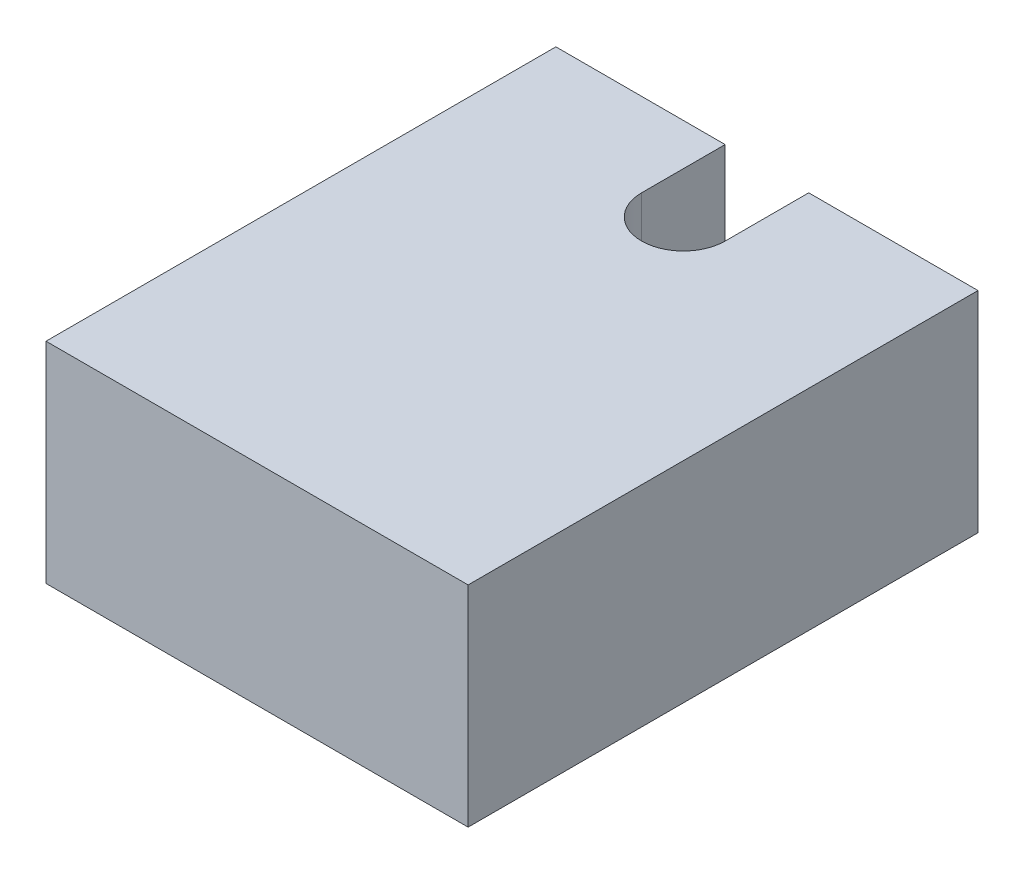
ISO-10303-21;
HEADER;
FILE_DESCRIPTION(('STEP AP214'),'2;1');
FILE_NAME('part.step','',(''),(''),'','','');
FILE_SCHEMA(('AUTOMOTIVE_DESIGN { 1 0 10303 214 1 1 1 1 }'));
ENDSEC;
DATA;
#1=APPLICATION_CONTEXT('core data for automotive mechanical design processes');
#2=APPLICATION_PROTOCOL_DEFINITION('international standard','automotive_design',2000,#1);
#3=PRODUCT_CONTEXT('',#1,'mechanical');
#4=PRODUCT('Part','Part','',(#3));
#5=PRODUCT_RELATED_PRODUCT_CATEGORY('part','',(#4));
#6=PRODUCT_DEFINITION_FORMATION('','',#4);
#7=PRODUCT_DEFINITION_CONTEXT('part definition',#1,'design');
#8=PRODUCT_DEFINITION('design','',#6,#7);
#9=PRODUCT_DEFINITION_SHAPE('','',#8);
#10=(LENGTH_UNIT() NAMED_UNIT(*) SI_UNIT(.MILLI.,.METRE.));
#11=(NAMED_UNIT(*) PLANE_ANGLE_UNIT() SI_UNIT($,.RADIAN.));
#12=(NAMED_UNIT(*) SI_UNIT($,.STERADIAN.) SOLID_ANGLE_UNIT());
#13=UNCERTAINTY_MEASURE_WITH_UNIT(LENGTH_MEASURE(1.E-05),#10,'distance_accuracy_value','');
#14=(GEOMETRIC_REPRESENTATION_CONTEXT(3) GLOBAL_UNCERTAINTY_ASSIGNED_CONTEXT((#13)) GLOBAL_UNIT_ASSIGNED_CONTEXT((#10,
#11,#12)) REPRESENTATION_CONTEXT('',''));
#15=CARTESIAN_POINT('',(0.,0.,0.));
#16=DIRECTION('',(0.,0.,1.));
#17=DIRECTION('',(1.,0.,0.));
#18=AXIS2_PLACEMENT_3D('',#15,#16,#17);
#19=CARTESIAN_POINT('',(2.025,2.51,-6.1));
#20=DIRECTION('',(-1.,0.,0.));
#21=DIRECTION('',(0.,0.,1.));
#22=AXIS2_PLACEMENT_3D('',#19,#20,#21);
#23=PLANE('',#22);
#24=DIRECTION('',(0.,0.,-1.));
#25=VECTOR('',#24,1.);
#26=CARTESIAN_POINT('',(2.025,0.,-6.1));
#27=LINE('',#26,#25);
#28=CARTESIAN_POINT('',(2.025,0.,-5.1));
#29=VERTEX_POINT('',#28);
#30=CARTESIAN_POINT('',(2.025,0.,-6.1));
#31=VERTEX_POINT('',#30);
#32=EDGE_CURVE('E91',#29,#31,#27,.T.);
#33=ORIENTED_EDGE('',*,*,#32,.T.);
#34=DIRECTION('',(0.,-1.,0.));
#35=VECTOR('',#34,1.);
#36=CARTESIAN_POINT('',(2.025,2.51,-6.1));
#37=LINE('',#36,#35);
#38=CARTESIAN_POINT('',(2.025,2.51,-6.1));
#39=VERTEX_POINT('',#38);
#40=EDGE_CURVE('E109',#39,#31,#37,.T.);
#41=ORIENTED_EDGE('',*,*,#40,.F.);
#42=DIRECTION('',(0.,0.,-1.));
#43=VECTOR('',#42,1.);
#44=CARTESIAN_POINT('',(2.025,2.51,-6.1));
#45=LINE('',#44,#43);
#46=CARTESIAN_POINT('',(2.025,2.51,-5.1));
#47=VERTEX_POINT('',#46);
#48=EDGE_CURVE('E106',#47,#39,#45,.T.);
#49=ORIENTED_EDGE('',*,*,#48,.F.);
#50=DIRECTION('',(0.,-1.,0.));
#51=VECTOR('',#50,1.);
#52=CARTESIAN_POINT('',(2.025,2.51,-5.1));
#53=LINE('',#52,#51);
#54=EDGE_CURVE('E104',#47,#29,#53,.T.);
#55=ORIENTED_EDGE('',*,*,#54,.T.);
#56=EDGE_LOOP('',(#33,#41,#49,#55));
#57=FACE_BOUND('',#56,.T.);
#58=CARTESIAN_POINT('',(2.025,1.255,-5.6));
#59=DIRECTION('',(-1.,0.,0.));
#60=DIRECTION('',(0.,0.,1.));
#61=AXIS2_PLACEMENT_3D('',#58,#59,#60);
#62=CIRCLE('',#61,0.25);
#63=CARTESIAN_POINT('',(2.025,1.255,-5.35));
#64=VERTEX_POINT('',#63);
#65=EDGE_CURVE('E11',#64,#64,#62,.F.);
#66=ORIENTED_EDGE('',*,*,#65,.F.);
#67=EDGE_LOOP('',(#66));
#68=FACE_BOUND('',#67,.T.);
#69=ADVANCED_FACE('F26',(#57,#68),#23,.F.);
#70=CARTESIAN_POINT('',(3.025,2.51,-5.1));
#71=DIRECTION('',(1.,0.,0.));
#72=DIRECTION('',(0.,0.,-1.));
#73=AXIS2_PLACEMENT_3D('',#70,#71,#72);
#74=PLANE('',#73);
#75=DIRECTION('',(0.,0.,1.));
#76=VECTOR('',#75,1.);
#77=CARTESIAN_POINT('',(3.025,0.,-5.1));
#78=LINE('',#77,#76);
#79=CARTESIAN_POINT('',(3.025,0.,-6.1));
#80=VERTEX_POINT('',#79);
#81=CARTESIAN_POINT('',(3.025,0.,-5.1));
#82=VERTEX_POINT('',#81);
#83=EDGE_CURVE('E124',#80,#82,#78,.T.);
#84=ORIENTED_EDGE('',*,*,#83,.T.);
#85=DIRECTION('',(0.,-1.,0.));
#86=VECTOR('',#85,1.);
#87=CARTESIAN_POINT('',(3.025,2.51,-5.1));
#88=LINE('',#87,#86);
#89=CARTESIAN_POINT('',(3.025,2.51,-5.1));
#90=VERTEX_POINT('',#89);
#91=EDGE_CURVE('E112',#90,#82,#88,.T.);
#92=ORIENTED_EDGE('',*,*,#91,.F.);
#93=DIRECTION('',(0.,0.,1.));
#94=VECTOR('',#93,1.);
#95=CARTESIAN_POINT('',(3.025,2.51,-5.1));
#96=LINE('',#95,#94);
#97=CARTESIAN_POINT('',(3.025,2.51,-6.1));
#98=VERTEX_POINT('',#97);
#99=EDGE_CURVE('E41',#98,#90,#96,.T.);
#100=ORIENTED_EDGE('',*,*,#99,.F.);
#101=DIRECTION('',(0.,-1.,0.));
#102=VECTOR('',#101,1.);
#103=CARTESIAN_POINT('',(3.025,2.51,-6.1));
#104=LINE('',#103,#102);
#105=EDGE_CURVE('E140',#98,#80,#104,.T.);
#106=ORIENTED_EDGE('',*,*,#105,.T.);
#107=EDGE_LOOP('',(#84,#92,#100,#106));
#108=FACE_BOUND('',#107,.T.);
#109=CARTESIAN_POINT('',(3.025,1.255,-5.6));
#110=DIRECTION('',(1.,0.,0.));
#111=DIRECTION('',(0.,0.,-1.));
#112=AXIS2_PLACEMENT_3D('',#109,#110,#111);
#113=CIRCLE('',#112,0.25);
#114=CARTESIAN_POINT('',(3.025,1.255,-5.85));
#115=VERTEX_POINT('',#114);
#116=EDGE_CURVE('E34',#115,#115,#113,.F.);
#117=ORIENTED_EDGE('',*,*,#116,.F.);
#118=EDGE_LOOP('',(#117));
#119=FACE_BOUND('',#118,.T.);
#120=ADVANCED_FACE('F161',(#108,#119),#74,.F.);
#121=CARTESIAN_POINT('',(2.525,2.51,-5.1));
#122=DIRECTION('',(0.,-1.,0.));
#123=DIRECTION('',(0.,0.,-1.));
#124=AXIS2_PLACEMENT_3D('',#121,#122,#123);
#125=CYLINDRICAL_SURFACE('',#124,0.5);
#126=CARTESIAN_POINT('',(2.525,0.,-5.1));
#127=DIRECTION('',(0.,-1.,0.));
#128=DIRECTION('',(0.,0.,1.));
#129=AXIS2_PLACEMENT_3D('',#126,#127,#128);
#130=CIRCLE('',#129,0.5);
#131=EDGE_CURVE('E96',#82,#29,#130,.T.);
#132=ORIENTED_EDGE('',*,*,#131,.T.);
#133=ORIENTED_EDGE('',*,*,#54,.F.);
#134=CARTESIAN_POINT('',(2.525,2.51,-5.1));
#135=DIRECTION('',(0.,-1.,0.));
#136=DIRECTION('',(0.,0.,1.));
#137=AXIS2_PLACEMENT_3D('',#134,#135,#136);
#138=CIRCLE('',#137,0.5);
#139=EDGE_CURVE('E126',#90,#47,#138,.T.);
#140=ORIENTED_EDGE('',*,*,#139,.F.);
#141=ORIENTED_EDGE('',*,*,#91,.T.);
#142=EDGE_LOOP('',(#132,#133,#140,#141));
#143=FACE_BOUND('',#142,.T.);
#144=ADVANCED_FACE('F28',(#143),#125,.F.);
#145=CARTESIAN_POINT('',(0.,2.51,-6.1));
#146=DIRECTION('',(0.,0.,1.));
#147=DIRECTION('',(1.,0.,0.));
#148=AXIS2_PLACEMENT_3D('',#145,#146,#147);
#149=PLANE('',#148);
#150=DIRECTION('',(-1.,0.,0.));
#151=VECTOR('',#150,1.);
#152=CARTESIAN_POINT('',(0.,0.,-6.1));
#153=LINE('',#152,#151);
#154=CARTESIAN_POINT('',(0.,0.,-6.1));
#155=VERTEX_POINT('',#154);
#156=EDGE_CURVE('E98',#31,#155,#153,.T.);
#157=ORIENTED_EDGE('',*,*,#156,.T.);
#158=DIRECTION('',(0.,-1.,0.));
#159=VECTOR('',#158,1.);
#160=CARTESIAN_POINT('',(0.,2.51,-6.1));
#161=LINE('',#160,#159);
#162=CARTESIAN_POINT('',(0.,2.51,-6.1));
#163=VERTEX_POINT('',#162);
#164=EDGE_CURVE('E152',#163,#155,#161,.T.);
#165=ORIENTED_EDGE('',*,*,#164,.F.);
#166=DIRECTION('',(-1.,0.,0.));
#167=VECTOR('',#166,1.);
#168=CARTESIAN_POINT('',(0.,2.51,-6.1));
#169=LINE('',#168,#167);
#170=EDGE_CURVE('E129',#39,#163,#169,.T.);
#171=ORIENTED_EDGE('',*,*,#170,.F.);
#172=ORIENTED_EDGE('',*,*,#40,.T.);
#173=EDGE_LOOP('',(#157,#165,#171,#172));
#174=FACE_BOUND('',#173,.T.);
#175=ADVANCED_FACE('F170',(#174),#149,.F.);
#176=CARTESIAN_POINT('',(0.,2.51,0.));
#177=DIRECTION('',(1.,0.,0.));
#178=DIRECTION('',(0.,0.,-1.));
#179=AXIS2_PLACEMENT_3D('',#176,#177,#178);
#180=PLANE('',#179);
#181=DIRECTION('',(0.,0.,1.));
#182=VECTOR('',#181,1.);
#183=CARTESIAN_POINT('',(0.,0.,0.));
#184=LINE('',#183,#182);
#185=CARTESIAN_POINT('',(0.,0.,0.));
#186=VERTEX_POINT('',#185);
#187=EDGE_CURVE('E116',#155,#186,#184,.T.);
#188=ORIENTED_EDGE('',*,*,#187,.T.);
#189=DIRECTION('',(0.,-1.,0.));
#190=VECTOR('',#189,1.);
#191=CARTESIAN_POINT('',(0.,2.51,0.));
#192=LINE('',#191,#190);
#193=CARTESIAN_POINT('',(0.,2.51,0.));
#194=VERTEX_POINT('',#193);
#195=EDGE_CURVE('E149',#194,#186,#192,.T.);
#196=ORIENTED_EDGE('',*,*,#195,.F.);
#197=DIRECTION('',(0.,0.,1.));
#198=VECTOR('',#197,1.);
#199=CARTESIAN_POINT('',(0.,2.51,0.));
#200=LINE('',#199,#198);
#201=EDGE_CURVE('E131',#163,#194,#200,.T.);
#202=ORIENTED_EDGE('',*,*,#201,.F.);
#203=ORIENTED_EDGE('',*,*,#164,.T.);
#204=EDGE_LOOP('',(#188,#196,#202,#203));
#205=FACE_BOUND('',#204,.T.);
#206=ADVANCED_FACE('F186',(#205),#180,.F.);
#207=CARTESIAN_POINT('',(5.05,2.51,0.));
#208=DIRECTION('',(0.,0.,-1.));
#209=DIRECTION('',(-1.,0.,0.));
#210=AXIS2_PLACEMENT_3D('',#207,#208,#209);
#211=PLANE('',#210);
#212=DIRECTION('',(1.,0.,0.));
#213=VECTOR('',#212,1.);
#214=CARTESIAN_POINT('',(5.05,0.,0.));
#215=LINE('',#214,#213);
#216=CARTESIAN_POINT('',(5.05,0.,0.));
#217=VERTEX_POINT('',#216);
#218=EDGE_CURVE('E118',#186,#217,#215,.T.);
#219=ORIENTED_EDGE('',*,*,#218,.T.);
#220=DIRECTION('',(0.,-1.,0.));
#221=VECTOR('',#220,1.);
#222=CARTESIAN_POINT('',(5.05,2.51,0.));
#223=LINE('',#222,#221);
#224=CARTESIAN_POINT('',(5.05,2.51,0.));
#225=VERTEX_POINT('',#224);
#226=EDGE_CURVE('E146',#225,#217,#223,.T.);
#227=ORIENTED_EDGE('',*,*,#226,.F.);
#228=DIRECTION('',(1.,0.,0.));
#229=VECTOR('',#228,1.);
#230=CARTESIAN_POINT('',(5.05,2.51,0.));
#231=LINE('',#230,#229);
#232=EDGE_CURVE('E133',#194,#225,#231,.T.);
#233=ORIENTED_EDGE('',*,*,#232,.F.);
#234=ORIENTED_EDGE('',*,*,#195,.T.);
#235=EDGE_LOOP('',(#219,#227,#233,#234));
#236=FACE_BOUND('',#235,.T.);
#237=ADVANCED_FACE('F182',(#236),#211,.F.);
#238=CARTESIAN_POINT('',(5.05,2.51,-6.1));
#239=DIRECTION('',(-1.,0.,0.));
#240=DIRECTION('',(0.,0.,1.));
#241=AXIS2_PLACEMENT_3D('',#238,#239,#240);
#242=PLANE('',#241);
#243=DIRECTION('',(0.,0.,-1.));
#244=VECTOR('',#243,1.);
#245=CARTESIAN_POINT('',(5.05,0.,-6.1));
#246=LINE('',#245,#244);
#247=CARTESIAN_POINT('',(5.05,0.,-6.1));
#248=VERTEX_POINT('',#247);
#249=EDGE_CURVE('E120',#217,#248,#246,.T.);
#250=ORIENTED_EDGE('',*,*,#249,.T.);
#251=DIRECTION('',(0.,-1.,0.));
#252=VECTOR('',#251,1.);
#253=CARTESIAN_POINT('',(5.05,2.51,-6.1));
#254=LINE('',#253,#252);
#255=CARTESIAN_POINT('',(5.05,2.51,-6.1));
#256=VERTEX_POINT('',#255);
#257=EDGE_CURVE('E143',#256,#248,#254,.T.);
#258=ORIENTED_EDGE('',*,*,#257,.F.);
#259=DIRECTION('',(0.,0.,-1.));
#260=VECTOR('',#259,1.);
#261=CARTESIAN_POINT('',(5.05,2.51,-6.1));
#262=LINE('',#261,#260);
#263=EDGE_CURVE('E135',#225,#256,#262,.T.);
#264=ORIENTED_EDGE('',*,*,#263,.F.);
#265=ORIENTED_EDGE('',*,*,#226,.T.);
#266=EDGE_LOOP('',(#250,#258,#264,#265));
#267=FACE_BOUND('',#266,.T.);
#268=ADVANCED_FACE('F178',(#267),#242,.F.);
#269=CARTESIAN_POINT('',(3.025,2.51,-6.1));
#270=DIRECTION('',(0.,0.,1.));
#271=DIRECTION('',(1.,0.,0.));
#272=AXIS2_PLACEMENT_3D('',#269,#270,#271);
#273=PLANE('',#272);
#274=DIRECTION('',(-1.,0.,0.));
#275=VECTOR('',#274,1.);
#276=CARTESIAN_POINT('',(3.025,0.,-6.1));
#277=LINE('',#276,#275);
#278=EDGE_CURVE('E122',#248,#80,#277,.T.);
#279=ORIENTED_EDGE('',*,*,#278,.T.);
#280=ORIENTED_EDGE('',*,*,#105,.F.);
#281=DIRECTION('',(-1.,0.,0.));
#282=VECTOR('',#281,1.);
#283=CARTESIAN_POINT('',(3.025,2.51,-6.1));
#284=LINE('',#283,#282);
#285=EDGE_CURVE('E46',#256,#98,#284,.T.);
#286=ORIENTED_EDGE('',*,*,#285,.F.);
#287=ORIENTED_EDGE('',*,*,#257,.T.);
#288=EDGE_LOOP('',(#279,#280,#286,#287));
#289=FACE_BOUND('',#288,.T.);
#290=ADVANCED_FACE('F175',(#289),#273,.F.);
#291=CARTESIAN_POINT('',(2.525,2.51,-5.1));
#292=DIRECTION('',(0.,1.,0.));
#293=DIRECTION('',(0.,0.,1.));
#294=AXIS2_PLACEMENT_3D('',#291,#292,#293);
#295=PLANE('',#294);
#296=ORIENTED_EDGE('',*,*,#139,.T.);
#297=ORIENTED_EDGE('',*,*,#48,.T.);
#298=ORIENTED_EDGE('',*,*,#170,.T.);
#299=ORIENTED_EDGE('',*,*,#201,.T.);
#300=ORIENTED_EDGE('',*,*,#232,.T.);
#301=ORIENTED_EDGE('',*,*,#263,.T.);
#302=ORIENTED_EDGE('',*,*,#285,.T.);
#303=ORIENTED_EDGE('',*,*,#99,.T.);
#304=EDGE_LOOP('',(#296,#297,#298,#299,#300,#301,#302,#303));
#305=FACE_BOUND('',#304,.T.);
#306=ADVANCED_FACE('F173',(#305),#295,.T.);
#307=CARTESIAN_POINT('',(2.525,0.,-5.1));
#308=DIRECTION('',(0.,1.,0.));
#309=DIRECTION('',(0.,0.,1.));
#310=AXIS2_PLACEMENT_3D('',#307,#308,#309);
#311=PLANE('',#310);
#312=ORIENTED_EDGE('',*,*,#131,.F.);
#313=ORIENTED_EDGE('',*,*,#83,.F.);
#314=ORIENTED_EDGE('',*,*,#278,.F.);
#315=ORIENTED_EDGE('',*,*,#249,.F.);
#316=ORIENTED_EDGE('',*,*,#218,.F.);
#317=ORIENTED_EDGE('',*,*,#187,.F.);
#318=ORIENTED_EDGE('',*,*,#156,.F.);
#319=ORIENTED_EDGE('',*,*,#32,.F.);
#320=EDGE_LOOP('',(#312,#313,#314,#315,#316,#317,#318,#319));
#321=FACE_BOUND('',#320,.T.);
#322=ADVANCED_FACE('F93',(#321),#311,.F.);
#323=CARTESIAN_POINT('',(3.025,1.255,-5.6));
#324=DIRECTION('',(-1.,0.,0.));
#325=DIRECTION('',(0.,0.,1.));
#326=AXIS2_PLACEMENT_3D('',#323,#324,#325);
#327=CYLINDRICAL_SURFACE('',#326,0.25);
#328=ORIENTED_EDGE('',*,*,#116,.T.);
#329=EDGE_LOOP('',(#328));
#330=FACE_BOUND('',#329,.T.);
#331=ORIENTED_EDGE('',*,*,#65,.T.);
#332=EDGE_LOOP('',(#331));
#333=FACE_BOUND('',#332,.T.);
#334=ADVANCED_FACE('F158',(#330,#333),#327,.T.);
#335=CLOSED_SHELL('',(#69,#120,#144,#175,#206,#237,#268,#290,#306,#322,#334));
#336=MANIFOLD_SOLID_BREP('B2',#335);
#337=ADVANCED_BREP_SHAPE_REPRESENTATION('',(#18,#336),#14);
#338=SHAPE_DEFINITION_REPRESENTATION(#9,#337);
ENDSEC;
END-ISO-10303-21;
